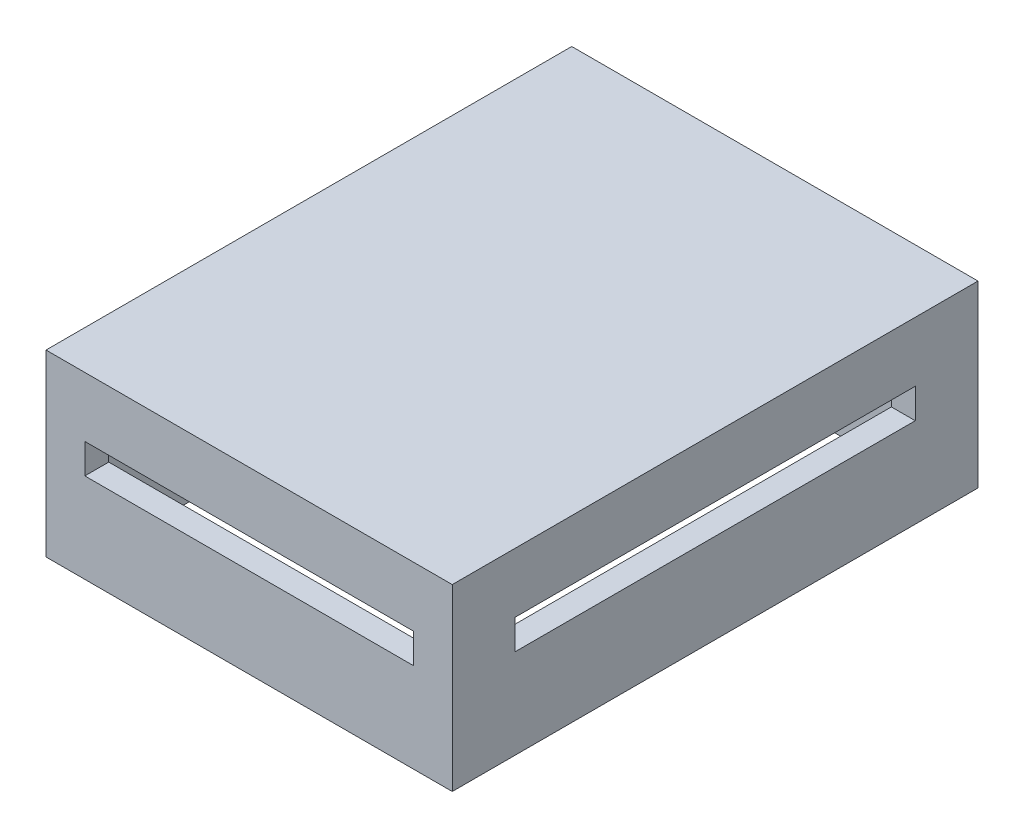
ISO-10303-21;
HEADER;
FILE_DESCRIPTION(('STEP AP214'),'2;1');
FILE_NAME('part.step','',(''),(''),'','','');
FILE_SCHEMA(('AUTOMOTIVE_DESIGN { 1 0 10303 214 1 1 1 1 }'));
ENDSEC;
DATA;
#1=APPLICATION_CONTEXT('core data for automotive mechanical design processes');
#2=APPLICATION_PROTOCOL_DEFINITION('international standard','automotive_design',2000,#1);
#3=PRODUCT_CONTEXT('',#1,'mechanical');
#4=PRODUCT('Part','Part','',(#3));
#5=PRODUCT_RELATED_PRODUCT_CATEGORY('part','',(#4));
#6=PRODUCT_DEFINITION_FORMATION('','',#4);
#7=PRODUCT_DEFINITION_CONTEXT('part definition',#1,'design');
#8=PRODUCT_DEFINITION('design','',#6,#7);
#9=PRODUCT_DEFINITION_SHAPE('','',#8);
#10=(LENGTH_UNIT() NAMED_UNIT(*) SI_UNIT(.MILLI.,.METRE.));
#11=(NAMED_UNIT(*) PLANE_ANGLE_UNIT() SI_UNIT($,.RADIAN.));
#12=(NAMED_UNIT(*) SI_UNIT($,.STERADIAN.) SOLID_ANGLE_UNIT());
#13=UNCERTAINTY_MEASURE_WITH_UNIT(LENGTH_MEASURE(1.E-05),#10,'distance_accuracy_value','');
#14=(GEOMETRIC_REPRESENTATION_CONTEXT(3) GLOBAL_UNCERTAINTY_ASSIGNED_CONTEXT((#13)) GLOBAL_UNIT_ASSIGNED_CONTEXT((#10,
#11,#12)) REPRESENTATION_CONTEXT('',''));
#15=CARTESIAN_POINT('',(0.,0.,0.));
#16=DIRECTION('',(0.,0.,1.));
#17=DIRECTION('',(1.,0.,0.));
#18=AXIS2_PLACEMENT_3D('',#15,#16,#17);
#19=CARTESIAN_POINT('',(0.,0.,0.));
#20=DIRECTION('',(0.,1.,0.));
#21=DIRECTION('',(0.,0.,1.));
#22=AXIS2_PLACEMENT_3D('',#19,#20,#21);
#23=PLANE('',#22);
#24=DIRECTION('',(1.,0.,0.));
#25=VECTOR('',#24,1.);
#26=CARTESIAN_POINT('',(-4.,0.,4.));
#27=LINE('',#26,#25);
#28=CARTESIAN_POINT('',(-4.,0.,4.));
#29=VERTEX_POINT('',#28);
#30=CARTESIAN_POINT('',(64.,0.,4.));
#31=VERTEX_POINT('',#30);
#32=EDGE_CURVE('E350',#29,#31,#27,.T.);
#33=ORIENTED_EDGE('',*,*,#32,.F.);
#34=DIRECTION('',(0.,0.,1.));
#35=VECTOR('',#34,1.);
#36=CARTESIAN_POINT('',(-4.,0.,4.));
#37=LINE('',#36,#35);
#38=CARTESIAN_POINT('',(-4.,0.,-84.));
#39=VERTEX_POINT('',#38);
#40=EDGE_CURVE('E357',#39,#29,#37,.T.);
#41=ORIENTED_EDGE('',*,*,#40,.F.);
#42=DIRECTION('',(-1.,0.,0.));
#43=VECTOR('',#42,1.);
#44=CARTESIAN_POINT('',(-4.,0.,-84.));
#45=LINE('',#44,#43);
#46=CARTESIAN_POINT('',(64.,0.,-84.));
#47=VERTEX_POINT('',#46);
#48=EDGE_CURVE('E355',#47,#39,#45,.T.);
#49=ORIENTED_EDGE('',*,*,#48,.F.);
#50=DIRECTION('',(0.,0.,-1.));
#51=VECTOR('',#50,1.);
#52=CARTESIAN_POINT('',(64.,0.,4.));
#53=LINE('',#52,#51);
#54=EDGE_CURVE('E353',#31,#47,#53,.T.);
#55=ORIENTED_EDGE('',*,*,#54,.F.);
#56=EDGE_LOOP('',(#33,#41,#49,#55));
#57=FACE_BOUND('',#56,.T.);
#58=DIRECTION('',(0.,0.,1.));
#59=VECTOR('',#58,1.);
#60=CARTESIAN_POINT('',(0.,0.,0.));
#61=LINE('',#60,#59);
#62=CARTESIAN_POINT('',(0.,0.,-80.));
#63=VERTEX_POINT('',#62);
#64=CARTESIAN_POINT('',(0.,0.,0.));
#65=VERTEX_POINT('',#64);
#66=EDGE_CURVE('E316',#63,#65,#61,.T.);
#67=ORIENTED_EDGE('',*,*,#66,.T.);
#68=DIRECTION('',(1.,0.,0.));
#69=VECTOR('',#68,1.);
#70=CARTESIAN_POINT('',(0.,0.,0.));
#71=LINE('',#70,#69);
#72=CARTESIAN_POINT('',(60.,0.,0.));
#73=VERTEX_POINT('',#72);
#74=EDGE_CURVE('E333',#65,#73,#71,.T.);
#75=ORIENTED_EDGE('',*,*,#74,.T.);
#76=DIRECTION('',(0.,0.,-1.));
#77=VECTOR('',#76,1.);
#78=CARTESIAN_POINT('',(60.,0.,0.));
#79=LINE('',#78,#77);
#80=CARTESIAN_POINT('',(60.,0.,-80.));
#81=VERTEX_POINT('',#80);
#82=EDGE_CURVE('E336',#73,#81,#79,.T.);
#83=ORIENTED_EDGE('',*,*,#82,.T.);
#84=DIRECTION('',(-1.,0.,0.));
#85=VECTOR('',#84,1.);
#86=CARTESIAN_POINT('',(0.,0.,-80.));
#87=LINE('',#86,#85);
#88=EDGE_CURVE('E321',#81,#63,#87,.T.);
#89=ORIENTED_EDGE('',*,*,#88,.T.);
#90=EDGE_LOOP('',(#67,#75,#83,#89));
#91=FACE_BOUND('',#90,.T.);
#92=ADVANCED_FACE('F41',(#57,#91),#23,.F.);
#93=CARTESIAN_POINT('',(-4.,27.,4.));
#94=DIRECTION('',(0.,0.,-1.));
#95=DIRECTION('',(-1.,0.,0.));
#96=AXIS2_PLACEMENT_3D('',#93,#94,#95);
#97=PLANE('',#96);
#98=DIRECTION('',(1.,0.,0.));
#99=VECTOR('',#98,1.);
#100=CARTESIAN_POINT('',(2.5,15.,4.));
#101=LINE('',#100,#99);
#102=CARTESIAN_POINT('',(2.5,15.,4.));
#103=VERTEX_POINT('',#102);
#104=CARTESIAN_POINT('',(57.5,15.,4.));
#105=VERTEX_POINT('',#104);
#106=EDGE_CURVE('E235',#103,#105,#101,.T.);
#107=ORIENTED_EDGE('',*,*,#106,.F.);
#108=DIRECTION('',(0.,-1.,0.));
#109=VECTOR('',#108,1.);
#110=CARTESIAN_POINT('',(2.5,15.,4.));
#111=LINE('',#110,#109);
#112=CARTESIAN_POINT('',(2.5,20.,4.));
#113=VERTEX_POINT('',#112);
#114=EDGE_CURVE('E56',#113,#103,#111,.T.);
#115=ORIENTED_EDGE('',*,*,#114,.F.);
#116=DIRECTION('',(-1.,0.,0.));
#117=VECTOR('',#116,1.);
#118=CARTESIAN_POINT('',(2.5,20.,4.));
#119=LINE('',#118,#117);
#120=CARTESIAN_POINT('',(57.5,20.,4.));
#121=VERTEX_POINT('',#120);
#122=EDGE_CURVE('E226',#121,#113,#119,.T.);
#123=ORIENTED_EDGE('',*,*,#122,.F.);
#124=DIRECTION('',(0.,1.,0.));
#125=VECTOR('',#124,1.);
#126=CARTESIAN_POINT('',(57.5,15.,4.));
#127=LINE('',#126,#125);
#128=EDGE_CURVE('E229',#105,#121,#127,.T.);
#129=ORIENTED_EDGE('',*,*,#128,.F.);
#130=EDGE_LOOP('',(#107,#115,#123,#129));
#131=FACE_BOUND('',#130,.T.);
#132=ORIENTED_EDGE('',*,*,#32,.T.);
#133=DIRECTION('',(0.,-1.,0.));
#134=VECTOR('',#133,1.);
#135=CARTESIAN_POINT('',(64.,27.,4.));
#136=LINE('',#135,#134);
#137=CARTESIAN_POINT('',(64.,30.,4.));
#138=VERTEX_POINT('',#137);
#139=EDGE_CURVE('E368',#138,#31,#136,.T.);
#140=ORIENTED_EDGE('',*,*,#139,.F.);
#141=DIRECTION('',(1.,0.,0.));
#142=VECTOR('',#141,1.);
#143=CARTESIAN_POINT('',(-4.,30.,4.));
#144=LINE('',#143,#142);
#145=CARTESIAN_POINT('',(-4.,30.,4.));
#146=VERTEX_POINT('',#145);
#147=EDGE_CURVE('E307',#146,#138,#144,.T.);
#148=ORIENTED_EDGE('',*,*,#147,.F.);
#149=DIRECTION('',(0.,-1.,0.));
#150=VECTOR('',#149,1.);
#151=CARTESIAN_POINT('',(-4.,27.,4.));
#152=LINE('',#151,#150);
#153=EDGE_CURVE('E359',#146,#29,#152,.T.);
#154=ORIENTED_EDGE('',*,*,#153,.T.);
#155=EDGE_LOOP('',(#132,#140,#148,#154));
#156=FACE_BOUND('',#155,.T.);
#157=ADVANCED_FACE('F43',(#131,#156),#97,.F.);
#158=CARTESIAN_POINT('',(64.,27.,4.));
#159=DIRECTION('',(-1.,0.,0.));
#160=DIRECTION('',(0.,0.,1.));
#161=AXIS2_PLACEMENT_3D('',#158,#159,#160);
#162=PLANE('',#161);
#163=DIRECTION('',(0.,0.,-1.));
#164=VECTOR('',#163,1.);
#165=CARTESIAN_POINT('',(64.,20.,-73.5));
#166=LINE('',#165,#164);
#167=CARTESIAN_POINT('',(64.,20.,-6.50000000000001));
#168=VERTEX_POINT('',#167);
#169=CARTESIAN_POINT('',(64.,20.,-73.5));
#170=VERTEX_POINT('',#169);
#171=EDGE_CURVE('E268',#168,#170,#166,.T.);
#172=ORIENTED_EDGE('',*,*,#171,.T.);
#173=DIRECTION('',(0.,-1.,0.));
#174=VECTOR('',#173,1.);
#175=CARTESIAN_POINT('',(64.,20.,-73.5));
#176=LINE('',#175,#174);
#177=CARTESIAN_POINT('',(64.,15.,-73.5));
#178=VERTEX_POINT('',#177);
#179=EDGE_CURVE('E258',#170,#178,#176,.T.);
#180=ORIENTED_EDGE('',*,*,#179,.T.);
#181=DIRECTION('',(0.,0.,1.));
#182=VECTOR('',#181,1.);
#183=CARTESIAN_POINT('',(64.,15.,-73.5));
#184=LINE('',#183,#182);
#185=CARTESIAN_POINT('',(64.,15.,-6.50000000000001));
#186=VERTEX_POINT('',#185);
#187=EDGE_CURVE('E261',#178,#186,#184,.T.);
#188=ORIENTED_EDGE('',*,*,#187,.T.);
#189=DIRECTION('',(0.,1.,0.));
#190=VECTOR('',#189,1.);
#191=CARTESIAN_POINT('',(64.,20.,-6.50000000000001));
#192=LINE('',#191,#190);
#193=EDGE_CURVE('E265',#186,#168,#192,.T.);
#194=ORIENTED_EDGE('',*,*,#193,.T.);
#195=EDGE_LOOP('',(#172,#180,#188,#194));
#196=FACE_BOUND('',#195,.T.);
#197=ORIENTED_EDGE('',*,*,#54,.T.);
#198=DIRECTION('',(0.,-1.,0.));
#199=VECTOR('',#198,1.);
#200=CARTESIAN_POINT('',(64.,27.,-84.));
#201=LINE('',#200,#199);
#202=CARTESIAN_POINT('',(64.,30.,-84.));
#203=VERTEX_POINT('',#202);
#204=EDGE_CURVE('E365',#203,#47,#201,.T.);
#205=ORIENTED_EDGE('',*,*,#204,.F.);
#206=DIRECTION('',(0.,0.,-1.));
#207=VECTOR('',#206,1.);
#208=CARTESIAN_POINT('',(64.,30.,4.));
#209=LINE('',#208,#207);
#210=EDGE_CURVE('E310',#138,#203,#209,.T.);
#211=ORIENTED_EDGE('',*,*,#210,.F.);
#212=ORIENTED_EDGE('',*,*,#139,.T.);
#213=EDGE_LOOP('',(#197,#205,#211,#212));
#214=FACE_BOUND('',#213,.T.);
#215=ADVANCED_FACE('F411',(#196,#214),#162,.F.);
#216=CARTESIAN_POINT('',(-4.,27.,-84.));
#217=DIRECTION('',(0.,0.,1.));
#218=DIRECTION('',(1.,0.,0.));
#219=AXIS2_PLACEMENT_3D('',#216,#217,#218);
#220=PLANE('',#219);
#221=DIRECTION('',(-1.,0.,0.));
#222=VECTOR('',#221,1.);
#223=CARTESIAN_POINT('',(2.5,20.,-84.));
#224=LINE('',#223,#222);
#225=CARTESIAN_POINT('',(57.5,20.,-84.));
#226=VERTEX_POINT('',#225);
#227=CARTESIAN_POINT('',(2.5,20.,-84.));
#228=VERTEX_POINT('',#227);
#229=EDGE_CURVE('E225',#226,#228,#224,.T.);
#230=ORIENTED_EDGE('',*,*,#229,.T.);
#231=DIRECTION('',(0.,-1.,0.));
#232=VECTOR('',#231,1.);
#233=CARTESIAN_POINT('',(2.5,15.,-84.));
#234=LINE('',#233,#232);
#235=CARTESIAN_POINT('',(2.5,15.,-84.));
#236=VERTEX_POINT('',#235);
#237=EDGE_CURVE('E208',#228,#236,#234,.T.);
#238=ORIENTED_EDGE('',*,*,#237,.T.);
#239=DIRECTION('',(1.,0.,0.));
#240=VECTOR('',#239,1.);
#241=CARTESIAN_POINT('',(2.5,15.,-84.));
#242=LINE('',#241,#240);
#243=CARTESIAN_POINT('',(57.5,15.,-84.));
#244=VERTEX_POINT('',#243);
#245=EDGE_CURVE('E217',#236,#244,#242,.T.);
#246=ORIENTED_EDGE('',*,*,#245,.T.);
#247=DIRECTION('',(0.,1.,0.));
#248=VECTOR('',#247,1.);
#249=CARTESIAN_POINT('',(57.5,15.,-84.));
#250=LINE('',#249,#248);
#251=EDGE_CURVE('E64',#244,#226,#250,.T.);
#252=ORIENTED_EDGE('',*,*,#251,.T.);
#253=EDGE_LOOP('',(#230,#238,#246,#252));
#254=FACE_BOUND('',#253,.T.);
#255=ORIENTED_EDGE('',*,*,#48,.T.);
#256=DIRECTION('',(0.,-1.,0.));
#257=VECTOR('',#256,1.);
#258=CARTESIAN_POINT('',(-4.,27.,-84.));
#259=LINE('',#258,#257);
#260=CARTESIAN_POINT('',(-4.,30.,-84.));
#261=VERTEX_POINT('',#260);
#262=EDGE_CURVE('E362',#261,#39,#259,.T.);
#263=ORIENTED_EDGE('',*,*,#262,.F.);
#264=DIRECTION('',(-1.,0.,0.));
#265=VECTOR('',#264,1.);
#266=CARTESIAN_POINT('',(-4.,30.,-84.));
#267=LINE('',#266,#265);
#268=EDGE_CURVE('E313',#203,#261,#267,.T.);
#269=ORIENTED_EDGE('',*,*,#268,.F.);
#270=ORIENTED_EDGE('',*,*,#204,.T.);
#271=EDGE_LOOP('',(#255,#263,#269,#270));
#272=FACE_BOUND('',#271,.T.);
#273=ADVANCED_FACE('F222',(#254,#272),#220,.F.);
#274=CARTESIAN_POINT('',(-4.,27.,4.));
#275=DIRECTION('',(1.,0.,0.));
#276=DIRECTION('',(0.,0.,-1.));
#277=AXIS2_PLACEMENT_3D('',#274,#275,#276);
#278=PLANE('',#277);
#279=DIRECTION('',(0.,0.,1.));
#280=VECTOR('',#279,1.);
#281=CARTESIAN_POINT('',(-4.,15.,-73.5));
#282=LINE('',#281,#280);
#283=CARTESIAN_POINT('',(-4.,15.,-73.5));
#284=VERTEX_POINT('',#283);
#285=CARTESIAN_POINT('',(-4.,15.,-6.50000000000001));
#286=VERTEX_POINT('',#285);
#287=EDGE_CURVE('E273',#284,#286,#282,.T.);
#288=ORIENTED_EDGE('',*,*,#287,.F.);
#289=DIRECTION('',(0.,-1.,0.));
#290=VECTOR('',#289,1.);
#291=CARTESIAN_POINT('',(-4.,20.,-73.5));
#292=LINE('',#291,#290);
#293=CARTESIAN_POINT('',(-4.,20.,-73.5));
#294=VERTEX_POINT('',#293);
#295=EDGE_CURVE('E257',#294,#284,#292,.T.);
#296=ORIENTED_EDGE('',*,*,#295,.F.);
#297=DIRECTION('',(0.,0.,-1.));
#298=VECTOR('',#297,1.);
#299=CARTESIAN_POINT('',(-4.,20.,-73.5));
#300=LINE('',#299,#298);
#301=CARTESIAN_POINT('',(-4.,20.,-6.50000000000001));
#302=VERTEX_POINT('',#301);
#303=EDGE_CURVE('E262',#302,#294,#300,.T.);
#304=ORIENTED_EDGE('',*,*,#303,.F.);
#305=DIRECTION('',(0.,1.,0.));
#306=VECTOR('',#305,1.);
#307=CARTESIAN_POINT('',(-4.,20.,-6.50000000000001));
#308=LINE('',#307,#306);
#309=EDGE_CURVE('E276',#286,#302,#308,.T.);
#310=ORIENTED_EDGE('',*,*,#309,.F.);
#311=EDGE_LOOP('',(#288,#296,#304,#310));
#312=FACE_BOUND('',#311,.T.);
#313=ORIENTED_EDGE('',*,*,#40,.T.);
#314=ORIENTED_EDGE('',*,*,#153,.F.);
#315=DIRECTION('',(0.,0.,1.));
#316=VECTOR('',#315,1.);
#317=CARTESIAN_POINT('',(-4.,30.,4.));
#318=LINE('',#317,#316);
#319=EDGE_CURVE('E304',#261,#146,#318,.T.);
#320=ORIENTED_EDGE('',*,*,#319,.F.);
#321=ORIENTED_EDGE('',*,*,#262,.T.);
#322=EDGE_LOOP('',(#313,#314,#320,#321));
#323=FACE_BOUND('',#322,.T.);
#324=ADVANCED_FACE('F419',(#312,#323),#278,.F.);
#325=CARTESIAN_POINT('',(0.,27.,0.));
#326=DIRECTION('',(1.,0.,0.));
#327=DIRECTION('',(0.,0.,-1.));
#328=AXIS2_PLACEMENT_3D('',#325,#326,#327);
#329=PLANE('',#328);
#330=DIRECTION('',(0.,1.,0.));
#331=VECTOR('',#330,1.);
#332=CARTESIAN_POINT('',(0.,27.,-73.5));
#333=LINE('',#332,#331);
#334=CARTESIAN_POINT('',(0.,15.,-73.5));
#335=VERTEX_POINT('',#334);
#336=CARTESIAN_POINT('',(0.,20.,-73.5));
#337=VERTEX_POINT('',#336);
#338=EDGE_CURVE('E302',#335,#337,#333,.T.);
#339=ORIENTED_EDGE('',*,*,#338,.F.);
#340=DIRECTION('',(0.,0.,-1.));
#341=VECTOR('',#340,1.);
#342=CARTESIAN_POINT('',(0.,15.,0.));
#343=LINE('',#342,#341);
#344=CARTESIAN_POINT('',(0.,15.,-6.50000000000001));
#345=VERTEX_POINT('',#344);
#346=EDGE_CURVE('E284',#345,#335,#343,.T.);
#347=ORIENTED_EDGE('',*,*,#346,.F.);
#348=DIRECTION('',(0.,-1.,0.));
#349=VECTOR('',#348,1.);
#350=CARTESIAN_POINT('',(0.,27.,-6.50000000000001));
#351=LINE('',#350,#349);
#352=CARTESIAN_POINT('',(0.,20.,-6.50000000000001));
#353=VERTEX_POINT('',#352);
#354=EDGE_CURVE('E297',#353,#345,#351,.T.);
#355=ORIENTED_EDGE('',*,*,#354,.F.);
#356=DIRECTION('',(0.,0.,1.));
#357=VECTOR('',#356,1.);
#358=CARTESIAN_POINT('',(0.,20.,0.));
#359=LINE('',#358,#357);
#360=EDGE_CURVE('E300',#337,#353,#359,.T.);
#361=ORIENTED_EDGE('',*,*,#360,.F.);
#362=EDGE_LOOP('',(#339,#347,#355,#361));
#363=FACE_BOUND('',#362,.T.);
#364=ORIENTED_EDGE('',*,*,#66,.F.);
#365=DIRECTION('',(0.,-1.,0.));
#366=VECTOR('',#365,1.);
#367=CARTESIAN_POINT('',(0.,27.,-80.));
#368=LINE('',#367,#366);
#369=CARTESIAN_POINT('',(0.,27.,-80.));
#370=VERTEX_POINT('',#369);
#371=EDGE_CURVE('E330',#370,#63,#368,.T.);
#372=ORIENTED_EDGE('',*,*,#371,.F.);
#373=DIRECTION('',(0.,0.,1.));
#374=VECTOR('',#373,1.);
#375=CARTESIAN_POINT('',(0.,27.,0.));
#376=LINE('',#375,#374);
#377=CARTESIAN_POINT('',(0.,27.,0.));
#378=VERTEX_POINT('',#377);
#379=EDGE_CURVE('E317',#370,#378,#376,.T.);
#380=ORIENTED_EDGE('',*,*,#379,.T.);
#381=DIRECTION('',(0.,-1.,0.));
#382=VECTOR('',#381,1.);
#383=CARTESIAN_POINT('',(0.,27.,0.));
#384=LINE('',#383,#382);
#385=EDGE_CURVE('E347',#378,#65,#384,.T.);
#386=ORIENTED_EDGE('',*,*,#385,.T.);
#387=EDGE_LOOP('',(#364,#372,#380,#386));
#388=FACE_BOUND('',#387,.T.);
#389=ADVANCED_FACE('F417',(#363,#388),#329,.T.);
#390=CARTESIAN_POINT('',(0.,27.,0.));
#391=DIRECTION('',(0.,0.,-1.));
#392=DIRECTION('',(-1.,0.,0.));
#393=AXIS2_PLACEMENT_3D('',#390,#391,#392);
#394=PLANE('',#393);
#395=DIRECTION('',(0.,1.,0.));
#396=VECTOR('',#395,1.);
#397=CARTESIAN_POINT('',(2.5,27.,0.));
#398=LINE('',#397,#396);
#399=CARTESIAN_POINT('',(2.5,15.,0.));
#400=VERTEX_POINT('',#399);
#401=CARTESIAN_POINT('',(2.5,20.,0.));
#402=VERTEX_POINT('',#401);
#403=EDGE_CURVE('E255',#400,#402,#398,.T.);
#404=ORIENTED_EDGE('',*,*,#403,.F.);
#405=DIRECTION('',(-1.,0.,0.));
#406=VECTOR('',#405,1.);
#407=CARTESIAN_POINT('',(0.,15.,0.));
#408=LINE('',#407,#406);
#409=CARTESIAN_POINT('',(57.5,15.,0.));
#410=VERTEX_POINT('',#409);
#411=EDGE_CURVE('E242',#410,#400,#408,.T.);
#412=ORIENTED_EDGE('',*,*,#411,.F.);
#413=DIRECTION('',(0.,-1.,0.));
#414=VECTOR('',#413,1.);
#415=CARTESIAN_POINT('',(57.5,27.,0.));
#416=LINE('',#415,#414);
#417=CARTESIAN_POINT('',(57.5,20.,0.));
#418=VERTEX_POINT('',#417);
#419=EDGE_CURVE('E250',#418,#410,#416,.T.);
#420=ORIENTED_EDGE('',*,*,#419,.F.);
#421=DIRECTION('',(1.,0.,0.));
#422=VECTOR('',#421,1.);
#423=CARTESIAN_POINT('',(0.,20.,0.));
#424=LINE('',#423,#422);
#425=EDGE_CURVE('E253',#402,#418,#424,.T.);
#426=ORIENTED_EDGE('',*,*,#425,.F.);
#427=EDGE_LOOP('',(#404,#412,#420,#426));
#428=FACE_BOUND('',#427,.T.);
#429=ORIENTED_EDGE('',*,*,#74,.F.);
#430=ORIENTED_EDGE('',*,*,#385,.F.);
#431=DIRECTION('',(1.,0.,0.));
#432=VECTOR('',#431,1.);
#433=CARTESIAN_POINT('',(0.,27.,0.));
#434=LINE('',#433,#432);
#435=CARTESIAN_POINT('',(60.,27.,0.));
#436=VERTEX_POINT('',#435);
#437=EDGE_CURVE('E320',#378,#436,#434,.T.);
#438=ORIENTED_EDGE('',*,*,#437,.T.);
#439=DIRECTION('',(0.,-1.,0.));
#440=VECTOR('',#439,1.);
#441=CARTESIAN_POINT('',(60.,27.,0.));
#442=LINE('',#441,#440);
#443=EDGE_CURVE('E345',#436,#73,#442,.T.);
#444=ORIENTED_EDGE('',*,*,#443,.T.);
#445=EDGE_LOOP('',(#429,#430,#438,#444));
#446=FACE_BOUND('',#445,.T.);
#447=ADVANCED_FACE('F460',(#428,#446),#394,.T.);
#448=CARTESIAN_POINT('',(60.,27.,0.));
#449=DIRECTION('',(-1.,0.,0.));
#450=DIRECTION('',(0.,0.,1.));
#451=AXIS2_PLACEMENT_3D('',#448,#449,#450);
#452=PLANE('',#451);
#453=DIRECTION('',(0.,-1.,0.));
#454=VECTOR('',#453,1.);
#455=CARTESIAN_POINT('',(60.,27.,-73.5));
#456=LINE('',#455,#454);
#457=CARTESIAN_POINT('',(60.,20.,-73.5));
#458=VERTEX_POINT('',#457);
#459=CARTESIAN_POINT('',(60.,15.,-73.5));
#460=VERTEX_POINT('',#459);
#461=EDGE_CURVE('E377',#458,#460,#456,.T.);
#462=ORIENTED_EDGE('',*,*,#461,.F.);
#463=DIRECTION('',(0.,0.,-1.));
#464=VECTOR('',#463,1.);
#465=CARTESIAN_POINT('',(60.,20.,0.));
#466=LINE('',#465,#464);
#467=CARTESIAN_POINT('',(60.,20.,-6.50000000000001));
#468=VERTEX_POINT('',#467);
#469=EDGE_CURVE('E375',#468,#458,#466,.T.);
#470=ORIENTED_EDGE('',*,*,#469,.F.);
#471=DIRECTION('',(0.,1.,0.));
#472=VECTOR('',#471,1.);
#473=CARTESIAN_POINT('',(60.,27.,-6.50000000000001));
#474=LINE('',#473,#472);
#475=CARTESIAN_POINT('',(60.,15.,-6.50000000000001));
#476=VERTEX_POINT('',#475);
#477=EDGE_CURVE('E373',#476,#468,#474,.T.);
#478=ORIENTED_EDGE('',*,*,#477,.F.);
#479=DIRECTION('',(0.,0.,1.));
#480=VECTOR('',#479,1.);
#481=CARTESIAN_POINT('',(60.,15.,0.));
#482=LINE('',#481,#480);
#483=EDGE_CURVE('E371',#460,#476,#482,.T.);
#484=ORIENTED_EDGE('',*,*,#483,.F.);
#485=EDGE_LOOP('',(#462,#470,#478,#484));
#486=FACE_BOUND('',#485,.T.);
#487=ORIENTED_EDGE('',*,*,#82,.F.);
#488=ORIENTED_EDGE('',*,*,#443,.F.);
#489=DIRECTION('',(0.,0.,-1.));
#490=VECTOR('',#489,1.);
#491=CARTESIAN_POINT('',(60.,27.,0.));
#492=LINE('',#491,#490);
#493=CARTESIAN_POINT('',(60.,27.,-80.));
#494=VERTEX_POINT('',#493);
#495=EDGE_CURVE('E324',#436,#494,#492,.T.);
#496=ORIENTED_EDGE('',*,*,#495,.T.);
#497=DIRECTION('',(0.,-1.,0.));
#498=VECTOR('',#497,1.);
#499=CARTESIAN_POINT('',(60.,27.,-80.));
#500=LINE('',#499,#498);
#501=EDGE_CURVE('E343',#494,#81,#500,.T.);
#502=ORIENTED_EDGE('',*,*,#501,.T.);
#503=EDGE_LOOP('',(#487,#488,#496,#502));
#504=FACE_BOUND('',#503,.T.);
#505=ADVANCED_FACE('F458',(#486,#504),#452,.T.);
#506=CARTESIAN_POINT('',(0.,27.,-80.));
#507=DIRECTION('',(0.,0.,1.));
#508=DIRECTION('',(1.,0.,0.));
#509=AXIS2_PLACEMENT_3D('',#506,#507,#508);
#510=PLANE('',#509);
#511=DIRECTION('',(0.,-1.,0.));
#512=VECTOR('',#511,1.);
#513=CARTESIAN_POINT('',(2.5,27.,-80.));
#514=LINE('',#513,#512);
#515=CARTESIAN_POINT('',(2.5,20.,-80.));
#516=VERTEX_POINT('',#515);
#517=CARTESIAN_POINT('',(2.5,15.,-80.));
#518=VERTEX_POINT('',#517);
#519=EDGE_CURVE('E11',#516,#518,#514,.T.);
#520=ORIENTED_EDGE('',*,*,#519,.F.);
#521=DIRECTION('',(-1.,0.,0.));
#522=VECTOR('',#521,1.);
#523=CARTESIAN_POINT('',(0.,20.,-80.));
#524=LINE('',#523,#522);
#525=CARTESIAN_POINT('',(57.5,20.,-80.));
#526=VERTEX_POINT('',#525);
#527=EDGE_CURVE('E49',#526,#516,#524,.T.);
#528=ORIENTED_EDGE('',*,*,#527,.F.);
#529=DIRECTION('',(0.,1.,0.));
#530=VECTOR('',#529,1.);
#531=CARTESIAN_POINT('',(57.5,27.,-80.));
#532=LINE('',#531,#530);
#533=CARTESIAN_POINT('',(57.5,15.,-80.));
#534=VERTEX_POINT('',#533);
#535=EDGE_CURVE('E382',#534,#526,#532,.T.);
#536=ORIENTED_EDGE('',*,*,#535,.F.);
#537=DIRECTION('',(1.,0.,0.));
#538=VECTOR('',#537,1.);
#539=CARTESIAN_POINT('',(0.,15.,-80.));
#540=LINE('',#539,#538);
#541=EDGE_CURVE('E380',#518,#534,#540,.T.);
#542=ORIENTED_EDGE('',*,*,#541,.F.);
#543=EDGE_LOOP('',(#520,#528,#536,#542));
#544=FACE_BOUND('',#543,.T.);
#545=ORIENTED_EDGE('',*,*,#88,.F.);
#546=ORIENTED_EDGE('',*,*,#501,.F.);
#547=DIRECTION('',(-1.,0.,0.));
#548=VECTOR('',#547,1.);
#549=CARTESIAN_POINT('',(0.,27.,-80.));
#550=LINE('',#549,#548);
#551=EDGE_CURVE('E327',#494,#370,#550,.T.);
#552=ORIENTED_EDGE('',*,*,#551,.T.);
#553=ORIENTED_EDGE('',*,*,#371,.T.);
#554=EDGE_LOOP('',(#545,#546,#552,#553));
#555=FACE_BOUND('',#554,.T.);
#556=ADVANCED_FACE('F388',(#544,#555),#510,.T.);
#557=CARTESIAN_POINT('',(0.,27.,0.));
#558=DIRECTION('',(0.,-1.,0.));
#559=DIRECTION('',(0.,0.,-1.));
#560=AXIS2_PLACEMENT_3D('',#557,#558,#559);
#561=PLANE('',#560);
#562=ORIENTED_EDGE('',*,*,#437,.F.);
#563=ORIENTED_EDGE('',*,*,#379,.F.);
#564=ORIENTED_EDGE('',*,*,#551,.F.);
#565=ORIENTED_EDGE('',*,*,#495,.F.);
#566=EDGE_LOOP('',(#562,#563,#564,#565));
#567=FACE_BOUND('',#566,.T.);
#568=ADVANCED_FACE('F442',(#567),#561,.T.);
#569=CARTESIAN_POINT('',(0.,30.,0.));
#570=DIRECTION('',(0.,-1.,0.));
#571=DIRECTION('',(0.,0.,-1.));
#572=AXIS2_PLACEMENT_3D('',#569,#570,#571);
#573=PLANE('',#572);
#574=ORIENTED_EDGE('',*,*,#319,.T.);
#575=ORIENTED_EDGE('',*,*,#147,.T.);
#576=ORIENTED_EDGE('',*,*,#210,.T.);
#577=ORIENTED_EDGE('',*,*,#268,.T.);
#578=EDGE_LOOP('',(#574,#575,#576,#577));
#579=FACE_BOUND('',#578,.T.);
#580=ADVANCED_FACE('F439',(#579),#573,.F.);
#581=CARTESIAN_POINT('',(64.,15.,-73.5));
#582=DIRECTION('',(0.,-1.,0.));
#583=DIRECTION('',(0.,0.,-1.));
#584=AXIS2_PLACEMENT_3D('',#581,#582,#583);
#585=PLANE('',#584);
#586=ORIENTED_EDGE('',*,*,#483,.T.);
#587=DIRECTION('',(-1.,0.,0.));
#588=VECTOR('',#587,1.);
#589=CARTESIAN_POINT('',(64.,15.,-6.50000000000001));
#590=LINE('',#589,#588);
#591=EDGE_CURVE('E290',#186,#476,#590,.T.);
#592=ORIENTED_EDGE('',*,*,#591,.F.);
#593=ORIENTED_EDGE('',*,*,#187,.F.);
#594=DIRECTION('',(-1.,0.,0.));
#595=VECTOR('',#594,1.);
#596=CARTESIAN_POINT('',(64.,15.,-73.5));
#597=LINE('',#596,#595);
#598=EDGE_CURVE('E294',#178,#460,#597,.T.);
#599=ORIENTED_EDGE('',*,*,#598,.T.);
#600=EDGE_LOOP('',(#586,#592,#593,#599));
#601=FACE_BOUND('',#600,.T.);
#602=ADVANCED_FACE('F441',(#601),#585,.F.);
#603=CARTESIAN_POINT('',(64.,20.,-6.50000000000001));
#604=DIRECTION('',(0.,0.,1.));
#605=DIRECTION('',(0.,-1.,0.));
#606=AXIS2_PLACEMENT_3D('',#603,#604,#605);
#607=PLANE('',#606);
#608=ORIENTED_EDGE('',*,*,#477,.T.);
#609=DIRECTION('',(-1.,0.,0.));
#610=VECTOR('',#609,1.);
#611=CARTESIAN_POINT('',(64.,20.,-6.50000000000001));
#612=LINE('',#611,#610);
#613=EDGE_CURVE('E286',#168,#468,#612,.T.);
#614=ORIENTED_EDGE('',*,*,#613,.F.);
#615=ORIENTED_EDGE('',*,*,#193,.F.);
#616=ORIENTED_EDGE('',*,*,#591,.T.);
#617=EDGE_LOOP('',(#608,#614,#615,#616));
#618=FACE_BOUND('',#617,.T.);
#619=ADVANCED_FACE('F448',(#618),#607,.F.);
#620=CARTESIAN_POINT('',(64.,20.,-73.5));
#621=DIRECTION('',(0.,1.,0.));
#622=DIRECTION('',(0.,0.,1.));
#623=AXIS2_PLACEMENT_3D('',#620,#621,#622);
#624=PLANE('',#623);
#625=ORIENTED_EDGE('',*,*,#469,.T.);
#626=DIRECTION('',(-1.,0.,0.));
#627=VECTOR('',#626,1.);
#628=CARTESIAN_POINT('',(64.,20.,-73.5));
#629=LINE('',#628,#627);
#630=EDGE_CURVE('E281',#170,#458,#629,.T.);
#631=ORIENTED_EDGE('',*,*,#630,.F.);
#632=ORIENTED_EDGE('',*,*,#171,.F.);
#633=ORIENTED_EDGE('',*,*,#613,.T.);
#634=EDGE_LOOP('',(#625,#631,#632,#633));
#635=FACE_BOUND('',#634,.T.);
#636=ADVANCED_FACE('F495',(#635),#624,.F.);
#637=CARTESIAN_POINT('',(64.,20.,-73.5));
#638=DIRECTION('',(0.,0.,-1.));
#639=DIRECTION('',(-1.,0.,0.));
#640=AXIS2_PLACEMENT_3D('',#637,#638,#639);
#641=PLANE('',#640);
#642=ORIENTED_EDGE('',*,*,#461,.T.);
#643=ORIENTED_EDGE('',*,*,#598,.F.);
#644=ORIENTED_EDGE('',*,*,#179,.F.);
#645=ORIENTED_EDGE('',*,*,#630,.T.);
#646=EDGE_LOOP('',(#642,#643,#644,#645));
#647=FACE_BOUND('',#646,.T.);
#648=ADVANCED_FACE('F454',(#647),#641,.F.);
#649=ORIENTED_EDGE('',*,*,#338,.T.);
#650=EDGE_CURVE('E285',#337,#294,#629,.T.);
#651=ORIENTED_EDGE('',*,*,#650,.T.);
#652=ORIENTED_EDGE('',*,*,#295,.T.);
#653=EDGE_CURVE('E271',#335,#284,#597,.T.);
#654=ORIENTED_EDGE('',*,*,#653,.F.);
#655=EDGE_LOOP('',(#649,#651,#652,#654));
#656=FACE_BOUND('',#655,.T.);
#657=ADVANCED_FACE('F512',(#656),#641,.F.);
#658=ORIENTED_EDGE('',*,*,#360,.T.);
#659=EDGE_CURVE('E289',#353,#302,#612,.T.);
#660=ORIENTED_EDGE('',*,*,#659,.T.);
#661=ORIENTED_EDGE('',*,*,#303,.T.);
#662=ORIENTED_EDGE('',*,*,#650,.F.);
#663=EDGE_LOOP('',(#658,#660,#661,#662));
#664=FACE_BOUND('',#663,.T.);
#665=ADVANCED_FACE('F499',(#664),#624,.F.);
#666=ORIENTED_EDGE('',*,*,#354,.T.);
#667=EDGE_CURVE('E293',#345,#286,#590,.T.);
#668=ORIENTED_EDGE('',*,*,#667,.T.);
#669=ORIENTED_EDGE('',*,*,#309,.T.);
#670=ORIENTED_EDGE('',*,*,#659,.F.);
#671=EDGE_LOOP('',(#666,#668,#669,#670));
#672=FACE_BOUND('',#671,.T.);
#673=ADVANCED_FACE('F502',(#672),#607,.F.);
#674=ORIENTED_EDGE('',*,*,#346,.T.);
#675=ORIENTED_EDGE('',*,*,#653,.T.);
#676=ORIENTED_EDGE('',*,*,#287,.T.);
#677=ORIENTED_EDGE('',*,*,#667,.F.);
#678=EDGE_LOOP('',(#674,#675,#676,#677));
#679=FACE_BOUND('',#678,.T.);
#680=ADVANCED_FACE('F400',(#679),#585,.F.);
#681=CARTESIAN_POINT('',(2.5,15.,-84.));
#682=DIRECTION('',(0.,-1.,0.));
#683=DIRECTION('',(0.,0.,-1.));
#684=AXIS2_PLACEMENT_3D('',#681,#682,#683);
#685=PLANE('',#684);
#686=ORIENTED_EDGE('',*,*,#541,.T.);
#687=DIRECTION('',(0.,0.,1.));
#688=VECTOR('',#687,1.);
#689=CARTESIAN_POINT('',(57.5,15.,-84.));
#690=LINE('',#689,#688);
#691=EDGE_CURVE('E219',#244,#534,#690,.T.);
#692=ORIENTED_EDGE('',*,*,#691,.F.);
#693=ORIENTED_EDGE('',*,*,#245,.F.);
#694=DIRECTION('',(0.,0.,1.));
#695=VECTOR('',#694,1.);
#696=CARTESIAN_POINT('',(2.5,15.,-84.));
#697=LINE('',#696,#695);
#698=EDGE_CURVE('E203',#236,#518,#697,.T.);
#699=ORIENTED_EDGE('',*,*,#698,.T.);
#700=EDGE_LOOP('',(#686,#692,#693,#699));
#701=FACE_BOUND('',#700,.T.);
#702=ADVANCED_FACE('F218',(#701),#685,.F.);
#703=CARTESIAN_POINT('',(57.5,15.,-84.));
#704=DIRECTION('',(1.,0.,0.));
#705=DIRECTION('',(0.,0.,-1.));
#706=AXIS2_PLACEMENT_3D('',#703,#704,#705);
#707=PLANE('',#706);
#708=ORIENTED_EDGE('',*,*,#535,.T.);
#709=DIRECTION('',(0.,0.,1.));
#710=VECTOR('',#709,1.);
#711=CARTESIAN_POINT('',(57.5,20.,-84.));
#712=LINE('',#711,#710);
#713=EDGE_CURVE('E244',#226,#526,#712,.T.);
#714=ORIENTED_EDGE('',*,*,#713,.F.);
#715=ORIENTED_EDGE('',*,*,#251,.F.);
#716=ORIENTED_EDGE('',*,*,#691,.T.);
#717=EDGE_LOOP('',(#708,#714,#715,#716));
#718=FACE_BOUND('',#717,.T.);
#719=ADVANCED_FACE('F390',(#718),#707,.F.);
#720=CARTESIAN_POINT('',(2.5,20.,-84.));
#721=DIRECTION('',(0.,1.,0.));
#722=DIRECTION('',(0.,0.,1.));
#723=AXIS2_PLACEMENT_3D('',#720,#721,#722);
#724=PLANE('',#723);
#725=ORIENTED_EDGE('',*,*,#527,.T.);
#726=DIRECTION('',(0.,0.,1.));
#727=VECTOR('',#726,1.);
#728=CARTESIAN_POINT('',(2.5,20.,-84.));
#729=LINE('',#728,#727);
#730=EDGE_CURVE('E240',#228,#516,#729,.T.);
#731=ORIENTED_EDGE('',*,*,#730,.F.);
#732=ORIENTED_EDGE('',*,*,#229,.F.);
#733=ORIENTED_EDGE('',*,*,#713,.T.);
#734=EDGE_LOOP('',(#725,#731,#732,#733));
#735=FACE_BOUND('',#734,.T.);
#736=ADVANCED_FACE('F385',(#735),#724,.F.);
#737=CARTESIAN_POINT('',(2.5,15.,-84.));
#738=DIRECTION('',(-1.,0.,0.));
#739=DIRECTION('',(0.,0.,1.));
#740=AXIS2_PLACEMENT_3D('',#737,#738,#739);
#741=PLANE('',#740);
#742=ORIENTED_EDGE('',*,*,#519,.T.);
#743=ORIENTED_EDGE('',*,*,#698,.F.);
#744=ORIENTED_EDGE('',*,*,#237,.F.);
#745=ORIENTED_EDGE('',*,*,#730,.T.);
#746=EDGE_LOOP('',(#742,#743,#744,#745));
#747=FACE_BOUND('',#746,.T.);
#748=ADVANCED_FACE('F205',(#747),#741,.F.);
#749=ORIENTED_EDGE('',*,*,#403,.T.);
#750=EDGE_CURVE('E243',#402,#113,#729,.T.);
#751=ORIENTED_EDGE('',*,*,#750,.T.);
#752=ORIENTED_EDGE('',*,*,#114,.T.);
#753=EDGE_CURVE('E214',#400,#103,#697,.T.);
#754=ORIENTED_EDGE('',*,*,#753,.F.);
#755=EDGE_LOOP('',(#749,#751,#752,#754));
#756=FACE_BOUND('',#755,.T.);
#757=ADVANCED_FACE('F482',(#756),#741,.F.);
#758=ORIENTED_EDGE('',*,*,#425,.T.);
#759=EDGE_CURVE('E247',#418,#121,#712,.T.);
#760=ORIENTED_EDGE('',*,*,#759,.T.);
#761=ORIENTED_EDGE('',*,*,#122,.T.);
#762=ORIENTED_EDGE('',*,*,#750,.F.);
#763=EDGE_LOOP('',(#758,#760,#761,#762));
#764=FACE_BOUND('',#763,.T.);
#765=ADVANCED_FACE('F399',(#764),#724,.F.);
#766=ORIENTED_EDGE('',*,*,#419,.T.);
#767=EDGE_CURVE('E213',#410,#105,#690,.T.);
#768=ORIENTED_EDGE('',*,*,#767,.T.);
#769=ORIENTED_EDGE('',*,*,#128,.T.);
#770=ORIENTED_EDGE('',*,*,#759,.F.);
#771=EDGE_LOOP('',(#766,#768,#769,#770));
#772=FACE_BOUND('',#771,.T.);
#773=ADVANCED_FACE('F393',(#772),#707,.F.);
#774=ORIENTED_EDGE('',*,*,#411,.T.);
#775=ORIENTED_EDGE('',*,*,#753,.T.);
#776=ORIENTED_EDGE('',*,*,#106,.T.);
#777=ORIENTED_EDGE('',*,*,#767,.F.);
#778=EDGE_LOOP('',(#774,#775,#776,#777));
#779=FACE_BOUND('',#778,.T.);
#780=ADVANCED_FACE('F402',(#779),#685,.F.);
#781=CLOSED_SHELL('',(#92,#157,#215,#273,#324,#389,#447,#505,#556,#568,#580,#602,#619,#636,#648,
#657,#665,#673,#680,#702,#719,#736,#748,#757,#765,#773,#780));
#782=MANIFOLD_SOLID_BREP('B2',#781);
#783=ADVANCED_BREP_SHAPE_REPRESENTATION('',(#18,#782),#14);
#784=SHAPE_DEFINITION_REPRESENTATION(#9,#783);
ENDSEC;
END-ISO-10303-21;
